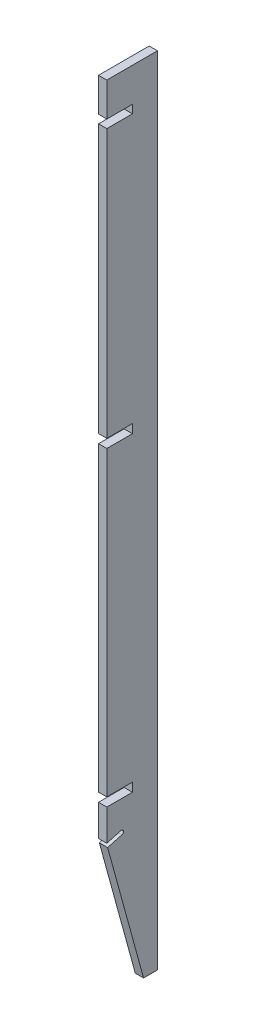
ISO-10303-21;
HEADER;
FILE_DESCRIPTION(('STEP AP214'),'2;1');
FILE_NAME('part.step','',(''),(''),'','','');
FILE_SCHEMA(('AUTOMOTIVE_DESIGN { 1 0 10303 214 1 1 1 1 }'));
ENDSEC;
DATA;
#1=APPLICATION_CONTEXT('core data for automotive mechanical design processes');
#2=APPLICATION_PROTOCOL_DEFINITION('international standard','automotive_design',2000,#1);
#3=PRODUCT_CONTEXT('',#1,'mechanical');
#4=PRODUCT('Part','Part','',(#3));
#5=PRODUCT_RELATED_PRODUCT_CATEGORY('part','',(#4));
#6=PRODUCT_DEFINITION_FORMATION('','',#4);
#7=PRODUCT_DEFINITION_CONTEXT('part definition',#1,'design');
#8=PRODUCT_DEFINITION('design','',#6,#7);
#9=PRODUCT_DEFINITION_SHAPE('','',#8);
#10=(LENGTH_UNIT() NAMED_UNIT(*) SI_UNIT(.MILLI.,.METRE.));
#11=(NAMED_UNIT(*) PLANE_ANGLE_UNIT() SI_UNIT($,.RADIAN.));
#12=(NAMED_UNIT(*) SI_UNIT($,.STERADIAN.) SOLID_ANGLE_UNIT());
#13=UNCERTAINTY_MEASURE_WITH_UNIT(LENGTH_MEASURE(1.E-05),#10,'distance_accuracy_value','');
#14=(GEOMETRIC_REPRESENTATION_CONTEXT(3) GLOBAL_UNCERTAINTY_ASSIGNED_CONTEXT((#13)) GLOBAL_UNIT_ASSIGNED_CONTEXT((#10,
#11,#12)) REPRESENTATION_CONTEXT('',''));
#15=CARTESIAN_POINT('',(0.,0.,0.));
#16=DIRECTION('',(0.,0.,1.));
#17=DIRECTION('',(1.,0.,0.));
#18=AXIS2_PLACEMENT_3D('',#15,#16,#17);
#19=CARTESIAN_POINT('',(-88.646,186.648691114934,38.1));
#20=DIRECTION('',(0.,-0.26471698178117,0.964326147917118));
#21=DIRECTION('',(0.,-0.964326147917118,-0.26471698178117));
#22=AXIS2_PLACEMENT_3D('',#19,#20,#21);
#23=PLANE('',#22);
#24=DIRECTION('',(0.,-0.964326147917118,-0.26471698178117));
#25=VECTOR('',#24,1.);
#26=CARTESIAN_POINT('',(-76.2,186.648691114934,38.1));
#27=LINE('',#26,#25);
#28=CARTESIAN_POINT('',(-76.2,320.899792352557,74.9532434769948));
#29=VERTEX_POINT('',#28);
#30=CARTESIAN_POINT('',(-76.2,124.055833972077,20.9176470588238));
#31=VERTEX_POINT('',#30);
#32=EDGE_CURVE('E290',#29,#31,#27,.T.);
#33=ORIENTED_EDGE('',*,*,#32,.F.);
#34=DIRECTION('',(-1.,0.,0.));
#35=VECTOR('',#34,1.);
#36=CARTESIAN_POINT('',(2294.93415908109,320.899792352557,74.9532434769948));
#37=LINE('',#36,#35);
#38=CARTESIAN_POINT('',(-88.646,320.899792352557,74.9532434769948));
#39=VERTEX_POINT('',#38);
#40=EDGE_CURVE('E37',#29,#39,#37,.T.);
#41=ORIENTED_EDGE('',*,*,#40,.T.);
#42=DIRECTION('',(0.,-0.964326147917118,-0.26471698178117));
#43=VECTOR('',#42,1.);
#44=CARTESIAN_POINT('',(-88.646,186.648691114934,38.1));
#45=LINE('',#44,#43);
#46=CARTESIAN_POINT('',(-88.646,124.055833972077,20.9176470588238));
#47=VERTEX_POINT('',#46);
#48=EDGE_CURVE('E301',#39,#47,#45,.T.);
#49=ORIENTED_EDGE('',*,*,#48,.T.);
#50=DIRECTION('',(1.,0.,0.));
#51=VECTOR('',#50,1.);
#52=CARTESIAN_POINT('',(-88.646,124.055833972077,20.9176470588238));
#53=LINE('',#52,#51);
#54=EDGE_CURVE('E234',#47,#31,#53,.T.);
#55=ORIENTED_EDGE('',*,*,#54,.T.);
#56=EDGE_LOOP('',(#33,#41,#49,#55));
#57=FACE_BOUND('',#56,.T.);
#58=ADVANCED_FACE('F16',(#57),#23,.T.);
#59=CARTESIAN_POINT('',(-88.646,822.325,76.2));
#60=DIRECTION('',(0.,0.,1.));
#61=DIRECTION('',(1.,0.,0.));
#62=AXIS2_PLACEMENT_3D('',#59,#60,#61);
#63=PLANE('',#62);
#64=DIRECTION('',(0.,-1.,0.));
#65=VECTOR('',#64,1.);
#66=CARTESIAN_POINT('',(-76.2,822.325,76.2));
#67=LINE('',#66,#65);
#68=CARTESIAN_POINT('',(-76.2,1257.554,76.2));
#69=VERTEX_POINT('',#68);
#70=CARTESIAN_POINT('',(-76.2,854.329,76.2));
#71=VERTEX_POINT('',#70);
#72=EDGE_CURVE('E297',#69,#71,#67,.T.);
#73=ORIENTED_EDGE('',*,*,#72,.F.);
#74=DIRECTION('',(-1.,0.,0.));
#75=VECTOR('',#74,1.);
#76=CARTESIAN_POINT('',(3476.61458781172,1257.554,76.2));
#77=LINE('',#76,#75);
#78=CARTESIAN_POINT('',(-88.646,1257.554,76.2));
#79=VERTEX_POINT('',#78);
#80=EDGE_CURVE('E335',#69,#79,#77,.T.);
#81=ORIENTED_EDGE('',*,*,#80,.T.);
#82=DIRECTION('',(0.,-1.,0.));
#83=VECTOR('',#82,1.);
#84=CARTESIAN_POINT('',(-88.646,822.325,76.2));
#85=LINE('',#84,#83);
#86=CARTESIAN_POINT('',(-88.646,854.329,76.2));
#87=VERTEX_POINT('',#86);
#88=EDGE_CURVE('E308',#79,#87,#85,.T.);
#89=ORIENTED_EDGE('',*,*,#88,.T.);
#90=DIRECTION('',(-1.,0.,0.));
#91=VECTOR('',#90,1.);
#92=CARTESIAN_POINT('',(3476.61458781172,854.329,76.2));
#93=LINE('',#92,#91);
#94=EDGE_CURVE('E316',#71,#87,#93,.T.);
#95=ORIENTED_EDGE('',*,*,#94,.F.);
#96=EDGE_LOOP('',(#73,#81,#89,#95));
#97=FACE_BOUND('',#96,.T.);
#98=ADVANCED_FACE('F436',(#97),#63,.T.);
#99=DIRECTION('',(-1.,0.,0.));
#100=VECTOR('',#99,1.);
#101=CARTESIAN_POINT('',(-88.646,327.142454536111,76.2));
#102=LINE('',#101,#100);
#103=CARTESIAN_POINT('',(-76.2,327.142454536111,76.2));
#104=VERTEX_POINT('',#103);
#105=CARTESIAN_POINT('',(-88.646,327.142454536111,76.2));
#106=VERTEX_POINT('',#105);
#107=EDGE_CURVE('E387',#104,#106,#102,.T.);
#108=ORIENTED_EDGE('',*,*,#107,.F.);
#109=CARTESIAN_POINT('',(-76.2,374.269,76.2));
#110=VERTEX_POINT('',#109);
#111=EDGE_CURVE('E298',#110,#104,#67,.T.);
#112=ORIENTED_EDGE('',*,*,#111,.F.);
#113=DIRECTION('',(-1.,0.,0.));
#114=VECTOR('',#113,1.);
#115=CARTESIAN_POINT('',(3476.61458781172,374.269,76.2));
#116=LINE('',#115,#114);
#117=CARTESIAN_POINT('',(-88.646,374.269,76.2));
#118=VERTEX_POINT('',#117);
#119=EDGE_CURVE('E366',#110,#118,#116,.T.);
#120=ORIENTED_EDGE('',*,*,#119,.T.);
#121=EDGE_CURVE('E286',#118,#106,#85,.T.);
#122=ORIENTED_EDGE('',*,*,#121,.T.);
#123=EDGE_LOOP('',(#108,#112,#120,#122));
#124=FACE_BOUND('',#123,.T.);
#125=ADVANCED_FACE('F454',(#124),#63,.T.);
#126=DIRECTION('',(-1.,0.,0.));
#127=VECTOR('',#126,1.);
#128=CARTESIAN_POINT('',(3476.61458781172,387.477,76.2));
#129=LINE('',#128,#127);
#130=CARTESIAN_POINT('',(-76.2,387.477,76.2));
#131=VERTEX_POINT('',#130);
#132=CARTESIAN_POINT('',(-88.646,387.477,76.2));
#133=VERTEX_POINT('',#132);
#134=EDGE_CURVE('E370',#131,#133,#129,.T.);
#135=ORIENTED_EDGE('',*,*,#134,.F.);
#136=CARTESIAN_POINT('',(-76.2,841.121,76.2));
#137=VERTEX_POINT('',#136);
#138=EDGE_CURVE('E439',#137,#131,#67,.T.);
#139=ORIENTED_EDGE('',*,*,#138,.F.);
#140=DIRECTION('',(-1.,0.,0.));
#141=VECTOR('',#140,1.);
#142=CARTESIAN_POINT('',(3476.61458781172,841.121,76.2));
#143=LINE('',#142,#141);
#144=CARTESIAN_POINT('',(-88.646,841.121,76.2));
#145=VERTEX_POINT('',#144);
#146=EDGE_CURVE('E319',#137,#145,#143,.T.);
#147=ORIENTED_EDGE('',*,*,#146,.T.);
#148=EDGE_CURVE('E461',#145,#133,#85,.T.);
#149=ORIENTED_EDGE('',*,*,#148,.T.);
#150=EDGE_LOOP('',(#135,#139,#147,#149));
#151=FACE_BOUND('',#150,.T.);
#152=ADVANCED_FACE('F480',(#151),#63,.T.);
#153=CARTESIAN_POINT('',(-88.646,709.72791698604,44.45));
#154=DIRECTION('',(1.,0.,0.));
#155=DIRECTION('',(0.,1.,0.));
#156=AXIS2_PLACEMENT_3D('',#153,#154,#155);
#157=PLANE('',#156);
#158=CARTESIAN_POINT('',(-88.646,329.844862792281,54.361571256692));
#159=DIRECTION('',(1.,0.,0.));
#160=DIRECTION('',(0.,1.,0.));
#161=AXIS2_PLACEMENT_3D('',#158,#159,#160);
#162=CIRCLE('',#161,3.175);
#163=CARTESIAN_POINT('',(-88.646,326.783127272644,53.5210948395368));
#164=VERTEX_POINT('',#163);
#165=CARTESIAN_POINT('',(-88.646,332.906598311917,55.2020476738473));
#166=VERTEX_POINT('',#165);
#167=EDGE_CURVE('E214',#164,#166,#162,.T.);
#168=ORIENTED_EDGE('',*,*,#167,.T.);
#169=DIRECTION('',(0.,-0.26471698178117,0.964326147917118));
#170=VECTOR('',#169,1.);
#171=CARTESIAN_POINT('',(-88.646,362.057095451444,-50.9890490487127));
#172=LINE('',#171,#170);
#173=EDGE_CURVE('E360',#166,#106,#172,.T.);
#174=ORIENTED_EDGE('',*,*,#173,.T.);
#175=ORIENTED_EDGE('',*,*,#121,.F.);
#176=DIRECTION('',(0.,0.,-1.));
#177=VECTOR('',#176,1.);
#178=CARTESIAN_POINT('',(-88.646,374.269,44.45));
#179=LINE('',#178,#177);
#180=CARTESIAN_POINT('',(-88.646,374.269,37.719));
#181=VERTEX_POINT('',#180);
#182=EDGE_CURVE('E373',#118,#181,#179,.T.);
#183=ORIENTED_EDGE('',*,*,#182,.T.);
#184=DIRECTION('',(0.,-1.,0.));
#185=VECTOR('',#184,1.);
#186=CARTESIAN_POINT('',(-88.646,847.725,37.719));
#187=LINE('',#186,#185);
#188=CARTESIAN_POINT('',(-88.646,387.477,37.719));
#189=VERTEX_POINT('',#188);
#190=EDGE_CURVE('E377',#189,#181,#187,.T.);
#191=ORIENTED_EDGE('',*,*,#190,.F.);
#192=DIRECTION('',(0.,0.,1.));
#193=VECTOR('',#192,1.);
#194=CARTESIAN_POINT('',(-88.646,387.477,44.45));
#195=LINE('',#194,#193);
#196=EDGE_CURVE('E349',#189,#133,#195,.T.);
#197=ORIENTED_EDGE('',*,*,#196,.T.);
#198=ORIENTED_EDGE('',*,*,#148,.F.);
#199=DIRECTION('',(0.,0.,-1.));
#200=VECTOR('',#199,1.);
#201=CARTESIAN_POINT('',(-88.646,841.121,38.1));
#202=LINE('',#201,#200);
#203=CARTESIAN_POINT('',(-88.646,841.121,37.719));
#204=VERTEX_POINT('',#203);
#205=EDGE_CURVE('E313',#145,#204,#202,.T.);
#206=ORIENTED_EDGE('',*,*,#205,.T.);
#207=DIRECTION('',(0.,-1.,0.));
#208=VECTOR('',#207,1.);
#209=CARTESIAN_POINT('',(-88.646,847.725,37.719));
#210=LINE('',#209,#208);
#211=CARTESIAN_POINT('',(-88.646,854.329,37.719));
#212=VERTEX_POINT('',#211);
#213=EDGE_CURVE('E330',#212,#204,#210,.T.);
#214=ORIENTED_EDGE('',*,*,#213,.F.);
#215=DIRECTION('',(0.,0.,1.));
#216=VECTOR('',#215,1.);
#217=CARTESIAN_POINT('',(-88.646,854.329,38.1));
#218=LINE('',#217,#216);
#219=EDGE_CURVE('E326',#212,#87,#218,.T.);
#220=ORIENTED_EDGE('',*,*,#219,.T.);
#221=ORIENTED_EDGE('',*,*,#88,.F.);
#222=DIRECTION('',(0.,0.,1.));
#223=VECTOR('',#222,1.);
#224=CARTESIAN_POINT('',(-88.646,1257.554,56.9595));
#225=LINE('',#224,#223);
#226=CARTESIAN_POINT('',(-88.646,1257.554,37.719));
#227=VERTEX_POINT('',#226);
#228=EDGE_CURVE('E357',#227,#79,#225,.T.);
#229=ORIENTED_EDGE('',*,*,#228,.F.);
#230=DIRECTION('',(0.,1.,0.));
#231=VECTOR('',#230,1.);
#232=CARTESIAN_POINT('',(-88.646,1263.777,37.719));
#233=LINE('',#232,#231);
#234=CARTESIAN_POINT('',(-88.646,1270.,37.719));
#235=VERTEX_POINT('',#234);
#236=EDGE_CURVE('E353',#227,#235,#233,.T.);
#237=ORIENTED_EDGE('',*,*,#236,.T.);
#238=DIRECTION('',(0.,0.,-1.));
#239=VECTOR('',#238,1.);
#240=CARTESIAN_POINT('',(-88.646,1270.,56.9595));
#241=LINE('',#240,#239);
#242=CARTESIAN_POINT('',(-88.646,1270.,76.2));
#243=VERTEX_POINT('',#242);
#244=EDGE_CURVE('E340',#243,#235,#241,.T.);
#245=ORIENTED_EDGE('',*,*,#244,.F.);
#246=CARTESIAN_POINT('',(-88.646,1320.8,76.2));
#247=VERTEX_POINT('',#246);
#248=EDGE_CURVE('E304',#247,#243,#85,.T.);
#249=ORIENTED_EDGE('',*,*,#248,.F.);
#250=DIRECTION('',(0.,0.,1.));
#251=VECTOR('',#250,1.);
#252=CARTESIAN_POINT('',(-88.646,1320.8,44.45));
#253=LINE('',#252,#251);
#254=CARTESIAN_POINT('',(-88.646,1320.8,0.));
#255=VERTEX_POINT('',#254);
#256=EDGE_CURVE('E275',#255,#247,#253,.T.);
#257=ORIENTED_EDGE('',*,*,#256,.F.);
#258=DIRECTION('',(0.,1.,0.));
#259=VECTOR('',#258,1.);
#260=CARTESIAN_POINT('',(-88.646,709.72791698604,1.196959198424E-13));
#261=LINE('',#260,#259);
#262=CARTESIAN_POINT('',(-88.646,124.055833972077,2.25611489484112E-13));
#263=VERTEX_POINT('',#262);
#264=EDGE_CURVE('E279',#263,#255,#261,.T.);
#265=ORIENTED_EDGE('',*,*,#264,.F.);
#266=DIRECTION('',(0.,0.,-1.));
#267=VECTOR('',#266,1.);
#268=CARTESIAN_POINT('',(-88.646,124.055833972077,20.9176470588238));
#269=LINE('',#268,#267);
#270=EDGE_CURVE('E207',#263,#47,#269,.F.);
#271=ORIENTED_EDGE('',*,*,#270,.T.);
#272=ORIENTED_EDGE('',*,*,#48,.F.);
#273=DIRECTION('',(0.,-0.26471698178117,0.964326147917118));
#274=VECTOR('',#273,1.);
#275=CARTESIAN_POINT('',(-88.646,355.93362441217,-52.6700018830231));
#276=LINE('',#275,#274);
#277=EDGE_CURVE('E392',#164,#39,#276,.T.);
#278=ORIENTED_EDGE('',*,*,#277,.F.);
#279=EDGE_LOOP('',(#168,#174,#175,#183,#191,#197,#198,#206,#214,#220,#221,#229,#237,#245,#249,
#257,#265,#271,#272,#278));
#280=FACE_BOUND('',#279,.T.);
#281=ADVANCED_FACE('F403',(#280),#157,.F.);
#282=CARTESIAN_POINT('',(-76.2,709.72791698604,44.45));
#283=DIRECTION('',(1.,0.,0.));
#284=DIRECTION('',(0.,1.,0.));
#285=AXIS2_PLACEMENT_3D('',#282,#283,#284);
#286=PLANE('',#285);
#287=DIRECTION('',(0.,-0.26471698178117,0.964326147917118));
#288=VECTOR('',#287,1.);
#289=CARTESIAN_POINT('',(-76.2,362.057095451444,-50.9890490487127));
#290=LINE('',#289,#288);
#291=CARTESIAN_POINT('',(-76.2,332.906598311917,55.2020476738473));
#292=VERTEX_POINT('',#291);
#293=EDGE_CURVE('E11',#292,#104,#290,.T.);
#294=ORIENTED_EDGE('',*,*,#293,.F.);
#295=CARTESIAN_POINT('',(-76.2,329.844862792281,54.361571256692));
#296=DIRECTION('',(1.,0.,0.));
#297=DIRECTION('',(0.,1.,0.));
#298=AXIS2_PLACEMENT_3D('',#295,#296,#297);
#299=CIRCLE('',#298,3.175);
#300=CARTESIAN_POINT('',(-76.2,326.783127272644,53.5210948395368));
#301=VERTEX_POINT('',#300);
#302=EDGE_CURVE('E25',#301,#292,#299,.T.);
#303=ORIENTED_EDGE('',*,*,#302,.F.);
#304=DIRECTION('',(0.,-0.26471698178117,0.964326147917118));
#305=VECTOR('',#304,1.);
#306=CARTESIAN_POINT('',(-76.2,355.93362441217,-52.6700018830231));
#307=LINE('',#306,#305);
#308=EDGE_CURVE('E198',#301,#29,#307,.T.);
#309=ORIENTED_EDGE('',*,*,#308,.T.);
#310=ORIENTED_EDGE('',*,*,#32,.T.);
#311=DIRECTION('',(0.,0.,1.));
#312=VECTOR('',#311,1.);
#313=CARTESIAN_POINT('',(-76.2,124.055833972077,44.4499999999961));
#314=LINE('',#313,#312);
#315=CARTESIAN_POINT('',(-76.2,124.055833972077,2.25611489484112E-13));
#316=VERTEX_POINT('',#315);
#317=EDGE_CURVE('E231',#31,#316,#314,.F.);
#318=ORIENTED_EDGE('',*,*,#317,.T.);
#319=DIRECTION('',(0.,1.,0.));
#320=VECTOR('',#319,1.);
#321=CARTESIAN_POINT('',(-76.2,709.72791698604,1.196959198424E-13));
#322=LINE('',#321,#320);
#323=CARTESIAN_POINT('',(-76.2,1320.8,0.));
#324=VERTEX_POINT('',#323);
#325=EDGE_CURVE('E287',#316,#324,#322,.T.);
#326=ORIENTED_EDGE('',*,*,#325,.T.);
#327=DIRECTION('',(0.,0.,1.));
#328=VECTOR('',#327,1.);
#329=CARTESIAN_POINT('',(-76.2,1320.8,44.45));
#330=LINE('',#329,#328);
#331=CARTESIAN_POINT('',(-76.2,1320.8,76.2));
#332=VERTEX_POINT('',#331);
#333=EDGE_CURVE('E282',#324,#332,#330,.T.);
#334=ORIENTED_EDGE('',*,*,#333,.T.);
#335=CARTESIAN_POINT('',(-76.2,1270.,76.2));
#336=VERTEX_POINT('',#335);
#337=EDGE_CURVE('E293',#332,#336,#67,.T.);
#338=ORIENTED_EDGE('',*,*,#337,.T.);
#339=DIRECTION('',(0.,0.,1.));
#340=VECTOR('',#339,1.);
#341=CARTESIAN_POINT('',(-76.2,1270.,44.45));
#342=LINE('',#341,#340);
#343=CARTESIAN_POINT('',(-76.2,1270.,37.719));
#344=VERTEX_POINT('',#343);
#345=EDGE_CURVE('E238',#344,#336,#342,.T.);
#346=ORIENTED_EDGE('',*,*,#345,.F.);
#347=DIRECTION('',(0.,-1.,0.));
#348=VECTOR('',#347,1.);
#349=CARTESIAN_POINT('',(-76.2,709.72791698604,37.719));
#350=LINE('',#349,#348);
#351=CARTESIAN_POINT('',(-76.2,1257.554,37.719));
#352=VERTEX_POINT('',#351);
#353=EDGE_CURVE('E241',#344,#352,#350,.T.);
#354=ORIENTED_EDGE('',*,*,#353,.T.);
#355=DIRECTION('',(0.,0.,-1.));
#356=VECTOR('',#355,1.);
#357=CARTESIAN_POINT('',(-76.2,1257.554,44.45));
#358=LINE('',#357,#356);
#359=EDGE_CURVE('E245',#69,#352,#358,.T.);
#360=ORIENTED_EDGE('',*,*,#359,.F.);
#361=ORIENTED_EDGE('',*,*,#72,.T.);
#362=DIRECTION('',(0.,0.,-1.));
#363=VECTOR('',#362,1.);
#364=CARTESIAN_POINT('',(-76.2,854.329,44.45));
#365=LINE('',#364,#363);
#366=CARTESIAN_POINT('',(-76.2,854.329,37.719));
#367=VERTEX_POINT('',#366);
#368=EDGE_CURVE('E263',#71,#367,#365,.T.);
#369=ORIENTED_EDGE('',*,*,#368,.T.);
#370=DIRECTION('',(0.,1.,0.));
#371=VECTOR('',#370,1.);
#372=CARTESIAN_POINT('',(-76.2,709.72791698604,37.719));
#373=LINE('',#372,#371);
#374=CARTESIAN_POINT('',(-76.2,841.121,37.719));
#375=VERTEX_POINT('',#374);
#376=EDGE_CURVE('E267',#375,#367,#373,.T.);
#377=ORIENTED_EDGE('',*,*,#376,.F.);
#378=DIRECTION('',(0.,0.,1.));
#379=VECTOR('',#378,1.);
#380=CARTESIAN_POINT('',(-76.2,841.121,44.45));
#381=LINE('',#380,#379);
#382=EDGE_CURVE('E259',#375,#137,#381,.T.);
#383=ORIENTED_EDGE('',*,*,#382,.T.);
#384=ORIENTED_EDGE('',*,*,#138,.T.);
#385=DIRECTION('',(0.,0.,-1.));
#386=VECTOR('',#385,1.);
#387=CARTESIAN_POINT('',(-76.2,387.477,44.45));
#388=LINE('',#387,#386);
#389=CARTESIAN_POINT('',(-76.2,387.477,37.719));
#390=VERTEX_POINT('',#389);
#391=EDGE_CURVE('E248',#131,#390,#388,.T.);
#392=ORIENTED_EDGE('',*,*,#391,.T.);
#393=DIRECTION('',(0.,1.,0.));
#394=VECTOR('',#393,1.);
#395=CARTESIAN_POINT('',(-76.2,709.72791698604,37.719));
#396=LINE('',#395,#394);
#397=CARTESIAN_POINT('',(-76.2,374.269,37.719));
#398=VERTEX_POINT('',#397);
#399=EDGE_CURVE('E252',#398,#390,#396,.T.);
#400=ORIENTED_EDGE('',*,*,#399,.F.);
#401=DIRECTION('',(0.,0.,1.));
#402=VECTOR('',#401,1.);
#403=CARTESIAN_POINT('',(-76.2,374.269,44.45));
#404=LINE('',#403,#402);
#405=EDGE_CURVE('E255',#398,#110,#404,.T.);
#406=ORIENTED_EDGE('',*,*,#405,.T.);
#407=ORIENTED_EDGE('',*,*,#111,.T.);
#408=EDGE_LOOP('',(#294,#303,#309,#310,#318,#326,#334,#338,#346,#354,#360,#361,#369,#377,#383,
#384,#392,#400,#406,#407));
#409=FACE_BOUND('',#408,.T.);
#410=ADVANCED_FACE('F219',(#409),#286,.T.);
#411=DIRECTION('',(-1.,0.,0.));
#412=VECTOR('',#411,1.);
#413=CARTESIAN_POINT('',(3476.61458781172,1270.,76.2));
#414=LINE('',#413,#412);
#415=EDGE_CURVE('E346',#336,#243,#414,.T.);
#416=ORIENTED_EDGE('',*,*,#415,.F.);
#417=ORIENTED_EDGE('',*,*,#337,.F.);
#418=DIRECTION('',(1.,0.,0.));
#419=VECTOR('',#418,1.);
#420=CARTESIAN_POINT('',(-88.646,1320.8,76.2));
#421=LINE('',#420,#419);
#422=EDGE_CURVE('E274',#247,#332,#421,.T.);
#423=ORIENTED_EDGE('',*,*,#422,.F.);
#424=ORIENTED_EDGE('',*,*,#248,.T.);
#425=EDGE_LOOP('',(#416,#417,#423,#424));
#426=FACE_BOUND('',#425,.T.);
#427=ADVANCED_FACE('F418',(#426),#63,.T.);
#428=CARTESIAN_POINT('',(-88.646,709.72791698604,1.196959198424E-13));
#429=DIRECTION('',(0.,0.,-1.));
#430=DIRECTION('',(0.,1.,0.));
#431=AXIS2_PLACEMENT_3D('',#428,#429,#430);
#432=PLANE('',#431);
#433=ORIENTED_EDGE('',*,*,#325,.F.);
#434=DIRECTION('',(-1.,0.,0.));
#435=VECTOR('',#434,1.);
#436=CARTESIAN_POINT('',(-88.646,124.055833972077,2.25611489484112E-13));
#437=LINE('',#436,#435);
#438=EDGE_CURVE('E50',#316,#263,#437,.T.);
#439=ORIENTED_EDGE('',*,*,#438,.T.);
#440=ORIENTED_EDGE('',*,*,#264,.T.);
#441=DIRECTION('',(1.,0.,0.));
#442=VECTOR('',#441,1.);
#443=CARTESIAN_POINT('',(-88.646,1320.8,0.));
#444=LINE('',#443,#442);
#445=EDGE_CURVE('E270',#255,#324,#444,.T.);
#446=ORIENTED_EDGE('',*,*,#445,.T.);
#447=EDGE_LOOP('',(#433,#439,#440,#446));
#448=FACE_BOUND('',#447,.T.);
#449=ADVANCED_FACE('F409',(#448),#432,.T.);
#450=CARTESIAN_POINT('',(-88.646,1320.8,38.1));
#451=DIRECTION('',(0.,1.,0.));
#452=DIRECTION('',(-1.,0.,0.));
#453=AXIS2_PLACEMENT_3D('',#450,#451,#452);
#454=PLANE('',#453);
#455=ORIENTED_EDGE('',*,*,#333,.F.);
#456=ORIENTED_EDGE('',*,*,#445,.F.);
#457=ORIENTED_EDGE('',*,*,#256,.T.);
#458=ORIENTED_EDGE('',*,*,#422,.T.);
#459=EDGE_LOOP('',(#455,#456,#457,#458));
#460=FACE_BOUND('',#459,.T.);
#461=ADVANCED_FACE('F413',(#460),#454,.T.);
#462=CARTESIAN_POINT('',(3476.61458781172,841.121,38.1));
#463=DIRECTION('',(0.,1.,0.));
#464=DIRECTION('',(-1.,0.,0.));
#465=AXIS2_PLACEMENT_3D('',#462,#463,#464);
#466=PLANE('',#465);
#467=DIRECTION('',(-1.,0.,0.));
#468=VECTOR('',#467,1.);
#469=CARTESIAN_POINT('',(3476.61458781172,841.121,37.719));
#470=LINE('',#469,#468);
#471=EDGE_CURVE('E309',#375,#204,#470,.T.);
#472=ORIENTED_EDGE('',*,*,#471,.T.);
#473=ORIENTED_EDGE('',*,*,#205,.F.);
#474=ORIENTED_EDGE('',*,*,#146,.F.);
#475=ORIENTED_EDGE('',*,*,#382,.F.);
#476=EDGE_LOOP('',(#472,#473,#474,#475));
#477=FACE_BOUND('',#476,.T.);
#478=ADVANCED_FACE('F479',(#477),#466,.T.);
#479=CARTESIAN_POINT('',(3476.61458781172,854.329,38.1));
#480=DIRECTION('',(0.,-1.,0.));
#481=DIRECTION('',(1.,0.,0.));
#482=AXIS2_PLACEMENT_3D('',#479,#480,#481);
#483=PLANE('',#482);
#484=ORIENTED_EDGE('',*,*,#94,.T.);
#485=ORIENTED_EDGE('',*,*,#219,.F.);
#486=DIRECTION('',(-1.,0.,0.));
#487=VECTOR('',#486,1.);
#488=CARTESIAN_POINT('',(3476.61458781172,854.329,37.719));
#489=LINE('',#488,#487);
#490=EDGE_CURVE('E312',#367,#212,#489,.T.);
#491=ORIENTED_EDGE('',*,*,#490,.F.);
#492=ORIENTED_EDGE('',*,*,#368,.F.);
#493=EDGE_LOOP('',(#484,#485,#491,#492));
#494=FACE_BOUND('',#493,.T.);
#495=ADVANCED_FACE('F473',(#494),#483,.T.);
#496=CARTESIAN_POINT('',(3476.61458781172,847.725,37.719));
#497=DIRECTION('',(0.,0.,-1.));
#498=DIRECTION('',(-1.,0.,0.));
#499=AXIS2_PLACEMENT_3D('',#496,#497,#498);
#500=PLANE('',#499);
#501=ORIENTED_EDGE('',*,*,#376,.T.);
#502=ORIENTED_EDGE('',*,*,#490,.T.);
#503=ORIENTED_EDGE('',*,*,#213,.T.);
#504=ORIENTED_EDGE('',*,*,#471,.F.);
#505=EDGE_LOOP('',(#501,#502,#503,#504));
#506=FACE_BOUND('',#505,.T.);
#507=ADVANCED_FACE('F477',(#506),#500,.F.);
#508=CARTESIAN_POINT('',(3476.61458781172,387.477,44.45));
#509=DIRECTION('',(0.,-1.,0.));
#510=DIRECTION('',(1.,0.,0.));
#511=AXIS2_PLACEMENT_3D('',#508,#509,#510);
#512=PLANE('',#511);
#513=ORIENTED_EDGE('',*,*,#134,.T.);
#514=ORIENTED_EDGE('',*,*,#196,.F.);
#515=DIRECTION('',(-1.,0.,0.));
#516=VECTOR('',#515,1.);
#517=CARTESIAN_POINT('',(3476.61458781172,387.477,37.719));
#518=LINE('',#517,#516);
#519=EDGE_CURVE('E334',#390,#189,#518,.T.);
#520=ORIENTED_EDGE('',*,*,#519,.F.);
#521=ORIENTED_EDGE('',*,*,#391,.F.);
#522=EDGE_LOOP('',(#513,#514,#520,#521));
#523=FACE_BOUND('',#522,.T.);
#524=ADVANCED_FACE('F484',(#523),#512,.T.);
#525=CARTESIAN_POINT('',(3476.61458781172,847.725,37.719));
#526=DIRECTION('',(0.,0.,-1.));
#527=DIRECTION('',(-1.,0.,0.));
#528=AXIS2_PLACEMENT_3D('',#525,#526,#527);
#529=PLANE('',#528);
#530=ORIENTED_EDGE('',*,*,#399,.T.);
#531=ORIENTED_EDGE('',*,*,#519,.T.);
#532=ORIENTED_EDGE('',*,*,#190,.T.);
#533=DIRECTION('',(-1.,0.,0.));
#534=VECTOR('',#533,1.);
#535=CARTESIAN_POINT('',(3476.61458781172,374.269,37.719));
#536=LINE('',#535,#534);
#537=EDGE_CURVE('E363',#398,#181,#536,.T.);
#538=ORIENTED_EDGE('',*,*,#537,.F.);
#539=EDGE_LOOP('',(#530,#531,#532,#538));
#540=FACE_BOUND('',#539,.T.);
#541=ADVANCED_FACE('F487',(#540),#529,.F.);
#542=CARTESIAN_POINT('',(3476.61458781172,374.269,44.45));
#543=DIRECTION('',(0.,1.,0.));
#544=DIRECTION('',(-1.,0.,0.));
#545=AXIS2_PLACEMENT_3D('',#542,#543,#544);
#546=PLANE('',#545);
#547=ORIENTED_EDGE('',*,*,#537,.T.);
#548=ORIENTED_EDGE('',*,*,#182,.F.);
#549=ORIENTED_EDGE('',*,*,#119,.F.);
#550=ORIENTED_EDGE('',*,*,#405,.F.);
#551=EDGE_LOOP('',(#547,#548,#549,#550));
#552=FACE_BOUND('',#551,.T.);
#553=ADVANCED_FACE('F489',(#552),#546,.T.);
#554=CARTESIAN_POINT('',(3476.61458781172,1270.,56.9595));
#555=DIRECTION('',(0.,1.,0.));
#556=DIRECTION('',(-1.,0.,0.));
#557=AXIS2_PLACEMENT_3D('',#554,#555,#556);
#558=PLANE('',#557);
#559=ORIENTED_EDGE('',*,*,#345,.T.);
#560=ORIENTED_EDGE('',*,*,#415,.T.);
#561=ORIENTED_EDGE('',*,*,#244,.T.);
#562=DIRECTION('',(-1.,0.,0.));
#563=VECTOR('',#562,1.);
#564=CARTESIAN_POINT('',(3476.61458781172,1270.,37.719));
#565=LINE('',#564,#563);
#566=EDGE_CURVE('E343',#344,#235,#565,.T.);
#567=ORIENTED_EDGE('',*,*,#566,.F.);
#568=EDGE_LOOP('',(#559,#560,#561,#567));
#569=FACE_BOUND('',#568,.T.);
#570=ADVANCED_FACE('F422',(#569),#558,.F.);
#571=CARTESIAN_POINT('',(3476.61458781172,1263.777,37.719));
#572=DIRECTION('',(0.,0.,1.));
#573=DIRECTION('',(1.,0.,0.));
#574=AXIS2_PLACEMENT_3D('',#571,#572,#573);
#575=PLANE('',#574);
#576=ORIENTED_EDGE('',*,*,#566,.T.);
#577=ORIENTED_EDGE('',*,*,#236,.F.);
#578=DIRECTION('',(-1.,0.,0.));
#579=VECTOR('',#578,1.);
#580=CARTESIAN_POINT('',(3476.61458781172,1257.554,37.719));
#581=LINE('',#580,#579);
#582=EDGE_CURVE('E339',#352,#227,#581,.T.);
#583=ORIENTED_EDGE('',*,*,#582,.F.);
#584=ORIENTED_EDGE('',*,*,#353,.F.);
#585=EDGE_LOOP('',(#576,#577,#583,#584));
#586=FACE_BOUND('',#585,.T.);
#587=ADVANCED_FACE('F429',(#586),#575,.T.);
#588=CARTESIAN_POINT('',(3476.61458781172,1257.554,56.9595));
#589=DIRECTION('',(0.,-1.,0.));
#590=DIRECTION('',(1.,0.,0.));
#591=AXIS2_PLACEMENT_3D('',#588,#589,#590);
#592=PLANE('',#591);
#593=ORIENTED_EDGE('',*,*,#359,.T.);
#594=ORIENTED_EDGE('',*,*,#582,.T.);
#595=ORIENTED_EDGE('',*,*,#228,.T.);
#596=ORIENTED_EDGE('',*,*,#80,.F.);
#597=EDGE_LOOP('',(#593,#594,#595,#596));
#598=FACE_BOUND('',#597,.T.);
#599=ADVANCED_FACE('F689',(#598),#592,.F.);
#600=CARTESIAN_POINT('',(-88.646,124.055833972077,20.9176470588238));
#601=DIRECTION('',(0.,1.,0.));
#602=DIRECTION('',(1.,0.,0.));
#603=AXIS2_PLACEMENT_3D('',#600,#601,#602);
#604=PLANE('',#603);
#605=ORIENTED_EDGE('',*,*,#270,.F.);
#606=ORIENTED_EDGE('',*,*,#438,.F.);
#607=ORIENTED_EDGE('',*,*,#317,.F.);
#608=ORIENTED_EDGE('',*,*,#54,.F.);
#609=EDGE_LOOP('',(#605,#606,#607,#608));
#610=FACE_BOUND('',#609,.T.);
#611=ADVANCED_FACE('F18',(#610),#604,.F.);
#612=CARTESIAN_POINT('',(2294.93415908109,330.049233053331,65.6110211158403));
#613=DIRECTION('',(0.,0.964326147917118,0.26471698178117));
#614=DIRECTION('',(0.,-0.26471698178117,0.964326147917118));
#615=AXIS2_PLACEMENT_3D('',#612,#613,#614);
#616=PLANE('',#615);
#617=DIRECTION('',(-1.,0.,0.));
#618=VECTOR('',#617,1.);
#619=CARTESIAN_POINT('',(2294.93415908109,332.906598311918,55.2020476738473));
#620=LINE('',#619,#618);
#621=EDGE_CURVE('E216',#292,#166,#620,.T.);
#622=ORIENTED_EDGE('',*,*,#621,.F.);
#623=ORIENTED_EDGE('',*,*,#293,.T.);
#624=ORIENTED_EDGE('',*,*,#107,.T.);
#625=ORIENTED_EDGE('',*,*,#173,.F.);
#626=EDGE_LOOP('',(#622,#623,#624,#625));
#627=FACE_BOUND('',#626,.T.);
#628=ADVANCED_FACE('F458',(#627),#616,.F.);
#629=CARTESIAN_POINT('',(2294.93415908109,329.844862792281,54.361571256692));
#630=DIRECTION('',(-1.,0.,0.));
#631=DIRECTION('',(0.,-1.,0.));
#632=AXIS2_PLACEMENT_3D('',#629,#630,#631);
#633=CYLINDRICAL_SURFACE('',#632,3.175);
#634=DIRECTION('',(-1.,0.,0.));
#635=VECTOR('',#634,1.);
#636=CARTESIAN_POINT('',(2294.93415908109,326.783127272644,53.5210948395368));
#637=LINE('',#636,#635);
#638=EDGE_CURVE('E201',#301,#164,#637,.T.);
#639=ORIENTED_EDGE('',*,*,#638,.F.);
#640=ORIENTED_EDGE('',*,*,#302,.T.);
#641=ORIENTED_EDGE('',*,*,#621,.T.);
#642=ORIENTED_EDGE('',*,*,#167,.F.);
#643=EDGE_LOOP('',(#639,#640,#641,#642));
#644=FACE_BOUND('',#643,.T.);
#645=ADVANCED_FACE('F210',(#644),#633,.F.);
#646=CARTESIAN_POINT('',(2294.93415908109,323.930746269763,63.9119113500311));
#647=DIRECTION('',(0.,0.964326147917118,0.26471698178117));
#648=DIRECTION('',(0.,-0.26471698178117,0.964326147917118));
#649=AXIS2_PLACEMENT_3D('',#646,#647,#648);
#650=PLANE('',#649);
#651=ORIENTED_EDGE('',*,*,#277,.T.);
#652=ORIENTED_EDGE('',*,*,#40,.F.);
#653=ORIENTED_EDGE('',*,*,#308,.F.);
#654=ORIENTED_EDGE('',*,*,#638,.T.);
#655=EDGE_LOOP('',(#651,#652,#653,#654));
#656=FACE_BOUND('',#655,.T.);
#657=ADVANCED_FACE('F200',(#656),#650,.T.);
#658=CLOSED_SHELL('',(#58,#98,#125,#152,#281,#410,#427,#449,#461,#478,#495,#507,#524,#541,#553,
#570,#587,#599,#611,#628,#645,#657));
#659=MANIFOLD_SOLID_BREP('B1',#658);
#660=ADVANCED_BREP_SHAPE_REPRESENTATION('',(#18,#659),#14);
#661=SHAPE_DEFINITION_REPRESENTATION(#9,#660);
ENDSEC;
END-ISO-10303-21;
